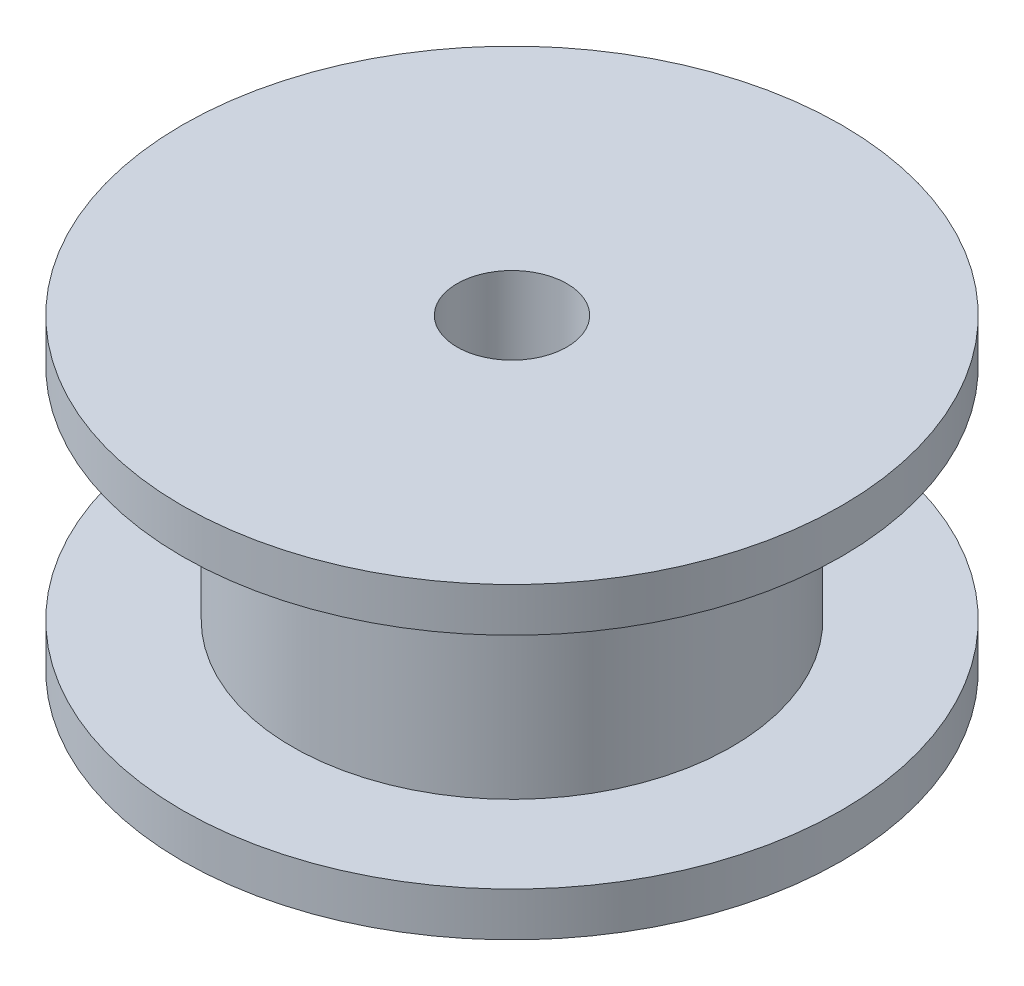
ISO-10303-21;
HEADER;
FILE_DESCRIPTION(('STEP AP214'),'2;1');
FILE_NAME('part.step','',(''),(''),'','','');
FILE_SCHEMA(('AUTOMOTIVE_DESIGN { 1 0 10303 214 1 1 1 1 }'));
ENDSEC;
DATA;
#1=APPLICATION_CONTEXT('core data for automotive mechanical design processes');
#2=APPLICATION_PROTOCOL_DEFINITION('international standard','automotive_design',2000,#1);
#3=PRODUCT_CONTEXT('',#1,'mechanical');
#4=PRODUCT('Part','Part','',(#3));
#5=PRODUCT_RELATED_PRODUCT_CATEGORY('part','',(#4));
#6=PRODUCT_DEFINITION_FORMATION('','',#4);
#7=PRODUCT_DEFINITION_CONTEXT('part definition',#1,'design');
#8=PRODUCT_DEFINITION('design','',#6,#7);
#9=PRODUCT_DEFINITION_SHAPE('','',#8);
#10=(LENGTH_UNIT() NAMED_UNIT(*) SI_UNIT(.MILLI.,.METRE.));
#11=(NAMED_UNIT(*) PLANE_ANGLE_UNIT() SI_UNIT($,.RADIAN.));
#12=(NAMED_UNIT(*) SI_UNIT($,.STERADIAN.) SOLID_ANGLE_UNIT());
#13=UNCERTAINTY_MEASURE_WITH_UNIT(LENGTH_MEASURE(1.E-05),#10,'distance_accuracy_value','');
#14=(GEOMETRIC_REPRESENTATION_CONTEXT(3) GLOBAL_UNCERTAINTY_ASSIGNED_CONTEXT((#13)) GLOBAL_UNIT_ASSIGNED_CONTEXT((#10,
#11,#12)) REPRESENTATION_CONTEXT('',''));
#15=CARTESIAN_POINT('',(0.,0.,0.));
#16=DIRECTION('',(0.,0.,1.));
#17=DIRECTION('',(1.,0.,0.));
#18=AXIS2_PLACEMENT_3D('',#15,#16,#17);
#19=CARTESIAN_POINT('',(0.,0.,0.));
#20=DIRECTION('',(0.,-1.,0.));
#21=DIRECTION('',(0.,0.,-1.));
#22=AXIS2_PLACEMENT_3D('',#19,#20,#21);
#23=CYLINDRICAL_SURFACE('',#22,3.);
#24=CARTESIAN_POINT('',(0.,2.4,0.));
#25=DIRECTION('',(0.,-1.,0.));
#26=DIRECTION('',(0.,0.,-1.));
#27=AXIS2_PLACEMENT_3D('',#24,#25,#26);
#28=CIRCLE('',#27,3.);
#29=CARTESIAN_POINT('',(0.,2.4,-3.));
#30=VERTEX_POINT('',#29);
#31=EDGE_CURVE('E62',#30,#30,#28,.T.);
#32=ORIENTED_EDGE('',*,*,#31,.F.);
#33=EDGE_LOOP('',(#32));
#34=FACE_BOUND('',#33,.T.);
#35=CARTESIAN_POINT('',(0.,2.8,0.));
#36=DIRECTION('',(0.,-1.,0.));
#37=DIRECTION('',(0.,0.,-1.));
#38=AXIS2_PLACEMENT_3D('',#35,#36,#37);
#39=CIRCLE('',#38,3.);
#40=CARTESIAN_POINT('',(0.,2.8,-3.));
#41=VERTEX_POINT('',#40);
#42=EDGE_CURVE('E10',#41,#41,#39,.T.);
#43=ORIENTED_EDGE('',*,*,#42,.T.);
#44=EDGE_LOOP('',(#43));
#45=FACE_BOUND('',#44,.T.);
#46=ADVANCED_FACE('F34',(#34,#45),#23,.T.);
#47=CARTESIAN_POINT('',(0.,2.8,3.));
#48=DIRECTION('',(0.,-1.,0.));
#49=DIRECTION('',(0.,0.,-1.));
#50=AXIS2_PLACEMENT_3D('',#47,#48,#49);
#51=PLANE('',#50);
#52=ORIENTED_EDGE('',*,*,#42,.F.);
#53=EDGE_LOOP('',(#52));
#54=FACE_BOUND('',#53,.T.);
#55=CARTESIAN_POINT('',(0.,2.8,0.));
#56=DIRECTION('',(0.,-1.,0.));
#57=DIRECTION('',(0.,0.,-1.));
#58=AXIS2_PLACEMENT_3D('',#55,#56,#57);
#59=CIRCLE('',#58,0.5);
#60=CARTESIAN_POINT('',(0.,2.8,-0.5));
#61=VERTEX_POINT('',#60);
#62=EDGE_CURVE('E40',#61,#61,#59,.T.);
#63=ORIENTED_EDGE('',*,*,#62,.T.);
#64=EDGE_LOOP('',(#63));
#65=FACE_BOUND('',#64,.T.);
#66=ADVANCED_FACE('F69',(#54,#65),#51,.F.);
#67=CARTESIAN_POINT('',(0.,0.,0.));
#68=DIRECTION('',(0.,-1.,0.));
#69=DIRECTION('',(0.,0.,-1.));
#70=AXIS2_PLACEMENT_3D('',#67,#68,#69);
#71=CYLINDRICAL_SURFACE('',#70,0.5);
#72=ORIENTED_EDGE('',*,*,#62,.F.);
#73=EDGE_LOOP('',(#72));
#74=FACE_BOUND('',#73,.T.);
#75=CARTESIAN_POINT('',(0.,0.,0.));
#76=DIRECTION('',(0.,-1.,0.));
#77=DIRECTION('',(0.,0.,-1.));
#78=AXIS2_PLACEMENT_3D('',#75,#76,#77);
#79=CIRCLE('',#78,0.5);
#80=CARTESIAN_POINT('',(0.,0.,-0.5));
#81=VERTEX_POINT('',#80);
#82=EDGE_CURVE('E44',#81,#81,#79,.T.);
#83=ORIENTED_EDGE('',*,*,#82,.T.);
#84=EDGE_LOOP('',(#83));
#85=FACE_BOUND('',#84,.T.);
#86=ADVANCED_FACE('F73',(#74,#85),#71,.F.);
#87=CARTESIAN_POINT('',(0.,0.,0.5));
#88=DIRECTION('',(0.,1.,0.));
#89=DIRECTION('',(0.,0.,1.));
#90=AXIS2_PLACEMENT_3D('',#87,#88,#89);
#91=PLANE('',#90);
#92=ORIENTED_EDGE('',*,*,#82,.F.);
#93=EDGE_LOOP('',(#92));
#94=FACE_BOUND('',#93,.T.);
#95=CARTESIAN_POINT('',(0.,0.,0.));
#96=DIRECTION('',(0.,-1.,0.));
#97=DIRECTION('',(0.,0.,-1.));
#98=AXIS2_PLACEMENT_3D('',#95,#96,#97);
#99=CIRCLE('',#98,3.);
#100=CARTESIAN_POINT('',(0.,0.,-3.));
#101=VERTEX_POINT('',#100);
#102=EDGE_CURVE('E48',#101,#101,#99,.T.);
#103=ORIENTED_EDGE('',*,*,#102,.T.);
#104=EDGE_LOOP('',(#103));
#105=FACE_BOUND('',#104,.T.);
#106=ADVANCED_FACE('F78',(#94,#105),#91,.F.);
#107=CARTESIAN_POINT('',(0.,0.,0.));
#108=DIRECTION('',(0.,-1.,0.));
#109=DIRECTION('',(0.,0.,-1.));
#110=AXIS2_PLACEMENT_3D('',#107,#108,#109);
#111=CYLINDRICAL_SURFACE('',#110,3.);
#112=ORIENTED_EDGE('',*,*,#102,.F.);
#113=EDGE_LOOP('',(#112));
#114=FACE_BOUND('',#113,.T.);
#115=CARTESIAN_POINT('',(0.,0.4,0.));
#116=DIRECTION('',(0.,-1.,0.));
#117=DIRECTION('',(0.,0.,-1.));
#118=AXIS2_PLACEMENT_3D('',#115,#116,#117);
#119=CIRCLE('',#118,3.);
#120=CARTESIAN_POINT('',(0.,0.4,-3.));
#121=VERTEX_POINT('',#120);
#122=EDGE_CURVE('E53',#121,#121,#119,.T.);
#123=ORIENTED_EDGE('',*,*,#122,.T.);
#124=EDGE_LOOP('',(#123));
#125=FACE_BOUND('',#124,.T.);
#126=ADVANCED_FACE('F84',(#114,#125),#111,.T.);
#127=CARTESIAN_POINT('',(0.,0.4,3.));
#128=DIRECTION('',(0.,-1.,0.));
#129=DIRECTION('',(0.,0.,-1.));
#130=AXIS2_PLACEMENT_3D('',#127,#128,#129);
#131=PLANE('',#130);
#132=ORIENTED_EDGE('',*,*,#122,.F.);
#133=EDGE_LOOP('',(#132));
#134=FACE_BOUND('',#133,.T.);
#135=CARTESIAN_POINT('',(0.,0.4,0.));
#136=DIRECTION('',(0.,-1.,0.));
#137=DIRECTION('',(0.,0.,-1.));
#138=AXIS2_PLACEMENT_3D('',#135,#136,#137);
#139=CIRCLE('',#138,2.);
#140=CARTESIAN_POINT('',(0.,0.4,-2.));
#141=VERTEX_POINT('',#140);
#142=EDGE_CURVE('E56',#141,#141,#139,.T.);
#143=ORIENTED_EDGE('',*,*,#142,.T.);
#144=EDGE_LOOP('',(#143));
#145=FACE_BOUND('',#144,.T.);
#146=ADVANCED_FACE('F88',(#134,#145),#131,.F.);
#147=CARTESIAN_POINT('',(0.,0.,0.));
#148=DIRECTION('',(0.,-1.,0.));
#149=DIRECTION('',(0.,0.,-1.));
#150=AXIS2_PLACEMENT_3D('',#147,#148,#149);
#151=CYLINDRICAL_SURFACE('',#150,2.);
#152=ORIENTED_EDGE('',*,*,#142,.F.);
#153=EDGE_LOOP('',(#152));
#154=FACE_BOUND('',#153,.T.);
#155=CARTESIAN_POINT('',(0.,2.4,0.));
#156=DIRECTION('',(0.,-1.,0.));
#157=DIRECTION('',(0.,0.,-1.));
#158=AXIS2_PLACEMENT_3D('',#155,#156,#157);
#159=CIRCLE('',#158,2.);
#160=CARTESIAN_POINT('',(0.,2.4,-2.));
#161=VERTEX_POINT('',#160);
#162=EDGE_CURVE('E59',#161,#161,#159,.T.);
#163=ORIENTED_EDGE('',*,*,#162,.T.);
#164=EDGE_LOOP('',(#163));
#165=FACE_BOUND('',#164,.T.);
#166=ADVANCED_FACE('F92',(#154,#165),#151,.T.);
#167=CARTESIAN_POINT('',(0.,2.4,2.));
#168=DIRECTION('',(0.,1.,0.));
#169=DIRECTION('',(0.,0.,1.));
#170=AXIS2_PLACEMENT_3D('',#167,#168,#169);
#171=PLANE('',#170);
#172=ORIENTED_EDGE('',*,*,#162,.F.);
#173=EDGE_LOOP('',(#172));
#174=FACE_BOUND('',#173,.T.);
#175=ORIENTED_EDGE('',*,*,#31,.T.);
#176=EDGE_LOOP('',(#175));
#177=FACE_BOUND('',#176,.T.);
#178=ADVANCED_FACE('F66',(#174,#177),#171,.F.);
#179=CLOSED_SHELL('',(#46,#66,#86,#106,#126,#146,#166,#178));
#180=MANIFOLD_SOLID_BREP('B2',#179);
#181=ADVANCED_BREP_SHAPE_REPRESENTATION('',(#18,#180),#14);
#182=SHAPE_DEFINITION_REPRESENTATION(#9,#181);
ENDSEC;
END-ISO-10303-21;
